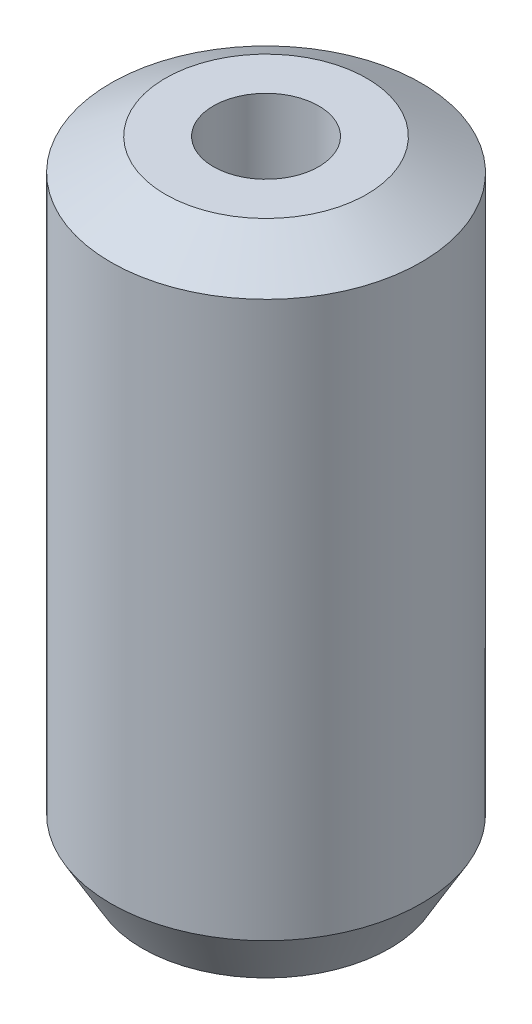
ISO-10303-21;
HEADER;
FILE_DESCRIPTION(('STEP AP214'),'2;1');
FILE_NAME('part.step','',(''),(''),'','','');
FILE_SCHEMA(('AUTOMOTIVE_DESIGN { 1 0 10303 214 1 1 1 1 }'));
ENDSEC;
DATA;
#1=APPLICATION_CONTEXT('core data for automotive mechanical design processes');
#2=APPLICATION_PROTOCOL_DEFINITION('international standard','automotive_design',2000,#1);
#3=PRODUCT_CONTEXT('',#1,'mechanical');
#4=PRODUCT('Part','Part','',(#3));
#5=PRODUCT_RELATED_PRODUCT_CATEGORY('part','',(#4));
#6=PRODUCT_DEFINITION_FORMATION('','',#4);
#7=PRODUCT_DEFINITION_CONTEXT('part definition',#1,'design');
#8=PRODUCT_DEFINITION('design','',#6,#7);
#9=PRODUCT_DEFINITION_SHAPE('','',#8);
#10=(LENGTH_UNIT() NAMED_UNIT(*) SI_UNIT(.MILLI.,.METRE.));
#11=(NAMED_UNIT(*) PLANE_ANGLE_UNIT() SI_UNIT($,.RADIAN.));
#12=(NAMED_UNIT(*) SI_UNIT($,.STERADIAN.) SOLID_ANGLE_UNIT());
#13=UNCERTAINTY_MEASURE_WITH_UNIT(LENGTH_MEASURE(1.E-05),#10,'distance_accuracy_value','');
#14=(GEOMETRIC_REPRESENTATION_CONTEXT(3) GLOBAL_UNCERTAINTY_ASSIGNED_CONTEXT((#13)) GLOBAL_UNIT_ASSIGNED_CONTEXT((#10,
#11,#12)) REPRESENTATION_CONTEXT('',''));
#15=CARTESIAN_POINT('',(0.,0.,0.));
#16=DIRECTION('',(0.,0.,1.));
#17=DIRECTION('',(1.,0.,0.));
#18=AXIS2_PLACEMENT_3D('',#15,#16,#17);
#19=CARTESIAN_POINT('',(0.,113.667346682607,0.));
#20=DIRECTION('',(0.,-1.,0.));
#21=DIRECTION('',(0.,0.,-1.));
#22=AXIS2_PLACEMENT_3D('',#19,#20,#21);
#23=CYLINDRICAL_SURFACE('',#22,27.5);
#24=CARTESIAN_POINT('',(0.,108.08939510548,0.));
#25=DIRECTION('',(0.,1.,0.));
#26=DIRECTION('',(0.,0.,1.));
#27=AXIS2_PLACEMENT_3D('',#24,#25,#26);
#28=CIRCLE('',#27,27.5);
#29=CARTESIAN_POINT('',(0.,108.08939510548,27.5));
#30=VERTEX_POINT('',#29);
#31=EDGE_CURVE('E50',#30,#30,#28,.F.);
#32=ORIENTED_EDGE('',*,*,#31,.T.);
#33=EDGE_LOOP('',(#32));
#34=FACE_BOUND('',#33,.T.);
#35=CARTESIAN_POINT('',(0.,9.66129553374356,0.));
#36=DIRECTION('',(0.,1.,0.));
#37=DIRECTION('',(0.,0.,1.));
#38=AXIS2_PLACEMENT_3D('',#35,#36,#37);
#39=CIRCLE('',#38,27.5);
#40=CARTESIAN_POINT('',(0.,9.66129553374356,27.5));
#41=VERTEX_POINT('',#40);
#42=EDGE_CURVE('E51',#41,#41,#39,.T.);
#43=ORIENTED_EDGE('',*,*,#42,.T.);
#44=EDGE_LOOP('',(#43));
#45=FACE_BOUND('',#44,.T.);
#46=ADVANCED_FACE('F39',(#34,#45),#23,.T.);
#47=CARTESIAN_POINT('',(0.,113.667346682607,0.));
#48=DIRECTION('',(0.,1.,0.));
#49=DIRECTION('',(0.,0.,1.));
#50=AXIS2_PLACEMENT_3D('',#47,#48,#49);
#51=PLANE('',#50);
#52=CARTESIAN_POINT('',(0.,113.667346682607,0.));
#53=DIRECTION('',(0.,1.,0.));
#54=DIRECTION('',(0.,0.,1.));
#55=AXIS2_PLACEMENT_3D('',#52,#53,#54);
#56=CIRCLE('',#55,17.8387044662565);
#57=CARTESIAN_POINT('',(0.,113.667346682607,17.8387044662565));
#58=VERTEX_POINT('',#57);
#59=EDGE_CURVE('E54',#58,#58,#56,.T.);
#60=ORIENTED_EDGE('',*,*,#59,.T.);
#61=EDGE_LOOP('',(#60));
#62=FACE_BOUND('',#61,.T.);
#63=CARTESIAN_POINT('',(0.,113.667346682607,0.));
#64=DIRECTION('',(0.,1.,0.));
#65=DIRECTION('',(0.,0.,1.));
#66=AXIS2_PLACEMENT_3D('',#63,#64,#65);
#67=CIRCLE('',#66,9.3359158369369);
#68=CARTESIAN_POINT('',(0.,113.667346682607,9.3359158369369));
#69=VERTEX_POINT('',#68);
#70=EDGE_CURVE('E58',#69,#69,#67,.T.);
#71=ORIENTED_EDGE('',*,*,#70,.F.);
#72=EDGE_LOOP('',(#71));
#73=FACE_BOUND('',#72,.T.);
#74=ADVANCED_FACE('F69',(#62,#73),#51,.T.);
#75=CARTESIAN_POINT('',(0.,0.,0.));
#76=DIRECTION('',(0.,1.,0.));
#77=DIRECTION('',(0.,0.,1.));
#78=AXIS2_PLACEMENT_3D('',#75,#76,#77);
#79=PLANE('',#78);
#80=CARTESIAN_POINT('',(0.,0.,0.));
#81=DIRECTION('',(0.,1.,0.));
#82=DIRECTION('',(0.,0.,1.));
#83=AXIS2_PLACEMENT_3D('',#80,#81,#82);
#84=CIRCLE('',#83,21.9220484228726);
#85=CARTESIAN_POINT('',(0.,0.,21.9220484228726));
#86=VERTEX_POINT('',#85);
#87=EDGE_CURVE('E10',#86,#86,#84,.F.);
#88=ORIENTED_EDGE('',*,*,#87,.T.);
#89=EDGE_LOOP('',(#88));
#90=FACE_BOUND('',#89,.T.);
#91=CARTESIAN_POINT('',(0.,0.,0.));
#92=DIRECTION('',(0.,1.,0.));
#93=DIRECTION('',(0.,0.,1.));
#94=AXIS2_PLACEMENT_3D('',#91,#92,#93);
#95=CIRCLE('',#94,9.3359158369369);
#96=CARTESIAN_POINT('',(0.,0.,9.3359158369369));
#97=VERTEX_POINT('',#96);
#98=EDGE_CURVE('E63',#97,#97,#95,.T.);
#99=ORIENTED_EDGE('',*,*,#98,.T.);
#100=EDGE_LOOP('',(#99));
#101=FACE_BOUND('',#100,.T.);
#102=ADVANCED_FACE('F75',(#90,#101),#79,.F.);
#103=CARTESIAN_POINT('',(0.,113.667346682607,0.));
#104=DIRECTION('',(0.,-1.,0.));
#105=DIRECTION('',(0.,0.,-1.));
#106=AXIS2_PLACEMENT_3D('',#103,#104,#105);
#107=CYLINDRICAL_SURFACE('',#106,9.3359158369369);
#108=ORIENTED_EDGE('',*,*,#70,.T.);
#109=EDGE_LOOP('',(#108));
#110=FACE_BOUND('',#109,.T.);
#111=ORIENTED_EDGE('',*,*,#98,.F.);
#112=EDGE_LOOP('',(#111));
#113=FACE_BOUND('',#112,.T.);
#114=ADVANCED_FACE('F70',(#110,#113),#107,.F.);
#115=CARTESIAN_POINT('',(0.,113.667346682607,0.));
#116=DIRECTION('',(0.,-1.,0.));
#117=DIRECTION('',(0.,0.,-1.));
#118=AXIS2_PLACEMENT_3D('',#115,#116,#117);
#119=CONICAL_SURFACE('',#118,17.8387044662565,1.04719755119659);
#120=ORIENTED_EDGE('',*,*,#31,.F.);
#121=EDGE_LOOP('',(#120));
#122=FACE_BOUND('',#121,.T.);
#123=ORIENTED_EDGE('',*,*,#59,.F.);
#124=EDGE_LOOP('',(#123));
#125=FACE_BOUND('',#124,.T.);
#126=ADVANCED_FACE('F81',(#122,#125),#119,.T.);
#127=CARTESIAN_POINT('',(0.,9.66129553374356,0.));
#128=DIRECTION('',(0.,1.,0.));
#129=DIRECTION('',(0.,0.,1.));
#130=AXIS2_PLACEMENT_3D('',#127,#128,#129);
#131=CONICAL_SURFACE('',#130,27.5,0.523598775598302);
#132=ORIENTED_EDGE('',*,*,#87,.F.);
#133=EDGE_LOOP('',(#132));
#134=FACE_BOUND('',#133,.T.);
#135=ORIENTED_EDGE('',*,*,#42,.F.);
#136=EDGE_LOOP('',(#135));
#137=FACE_BOUND('',#136,.T.);
#138=ADVANCED_FACE('F45',(#134,#137),#131,.T.);
#139=CLOSED_SHELL('',(#46,#74,#102,#114,#126,#138));
#140=MANIFOLD_SOLID_BREP('B2',#139);
#141=ADVANCED_BREP_SHAPE_REPRESENTATION('',(#18,#140),#14);
#142=SHAPE_DEFINITION_REPRESENTATION(#9,#141);
ENDSEC;
END-ISO-10303-21;
